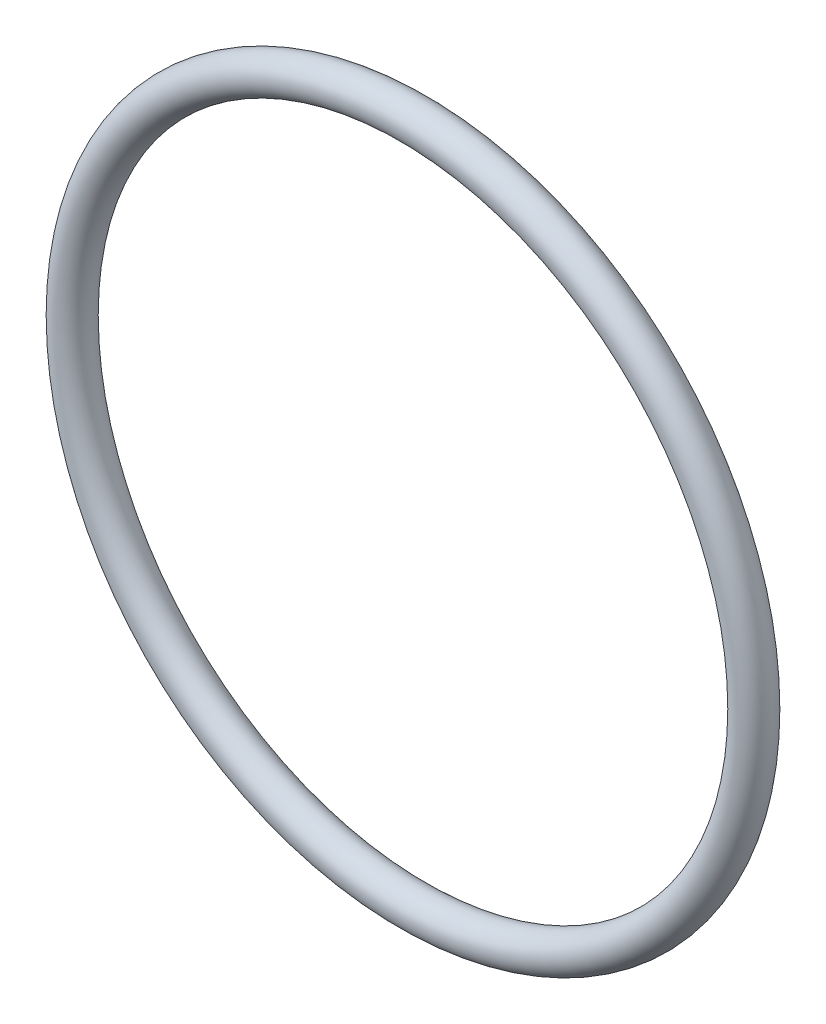
ISO-10303-21;
HEADER;
FILE_DESCRIPTION(('STEP AP214'),'2;1');
FILE_NAME('part.step','',(''),(''),'','','');
FILE_SCHEMA(('AUTOMOTIVE_DESIGN { 1 0 10303 214 1 1 1 1 }'));
ENDSEC;
DATA;
#1=APPLICATION_CONTEXT('core data for automotive mechanical design processes');
#2=APPLICATION_PROTOCOL_DEFINITION('international standard','automotive_design',2000,#1);
#3=PRODUCT_CONTEXT('',#1,'mechanical');
#4=PRODUCT('Part','Part','',(#3));
#5=PRODUCT_RELATED_PRODUCT_CATEGORY('part','',(#4));
#6=PRODUCT_DEFINITION_FORMATION('','',#4);
#7=PRODUCT_DEFINITION_CONTEXT('part definition',#1,'design');
#8=PRODUCT_DEFINITION('design','',#6,#7);
#9=PRODUCT_DEFINITION_SHAPE('','',#8);
#10=(LENGTH_UNIT() NAMED_UNIT(*) SI_UNIT(.MILLI.,.METRE.));
#11=(NAMED_UNIT(*) PLANE_ANGLE_UNIT() SI_UNIT($,.RADIAN.));
#12=(NAMED_UNIT(*) SI_UNIT($,.STERADIAN.) SOLID_ANGLE_UNIT());
#13=UNCERTAINTY_MEASURE_WITH_UNIT(LENGTH_MEASURE(1.E-05),#10,'distance_accuracy_value','');
#14=(GEOMETRIC_REPRESENTATION_CONTEXT(3) GLOBAL_UNCERTAINTY_ASSIGNED_CONTEXT((#13)) GLOBAL_UNIT_ASSIGNED_CONTEXT((#10,
#11,#12)) REPRESENTATION_CONTEXT('',''));
#15=CARTESIAN_POINT('',(0.,0.,0.));
#16=DIRECTION('',(0.,0.,1.));
#17=DIRECTION('',(1.,0.,0.));
#18=AXIS2_PLACEMENT_3D('',#15,#16,#17);
#19=CARTESIAN_POINT('',(0.,0.,0.));
#20=DIRECTION('',(0.,0.,1.));
#21=DIRECTION('',(1.,0.,0.));
#22=AXIS2_PLACEMENT_3D('',#19,#20,#21);
#23=TOROIDAL_SURFACE('',#22,18.5,1.);
#24=CARTESIAN_POINT('',(19.5,0.,0.));
#25=VERTEX_POINT('',#24);
#26=VERTEX_LOOP('',#25);
#27=FACE_BOUND('',#26,.T.);
#28=ADVANCED_FACE('F35',(#27),#23,.T.);
#29=CLOSED_SHELL('',(#28));
#30=MANIFOLD_SOLID_BREP('B2',#29);
#31=ADVANCED_BREP_SHAPE_REPRESENTATION('',(#18,#30),#14);
#32=SHAPE_DEFINITION_REPRESENTATION(#9,#31);
ENDSEC;
END-ISO-10303-21;
